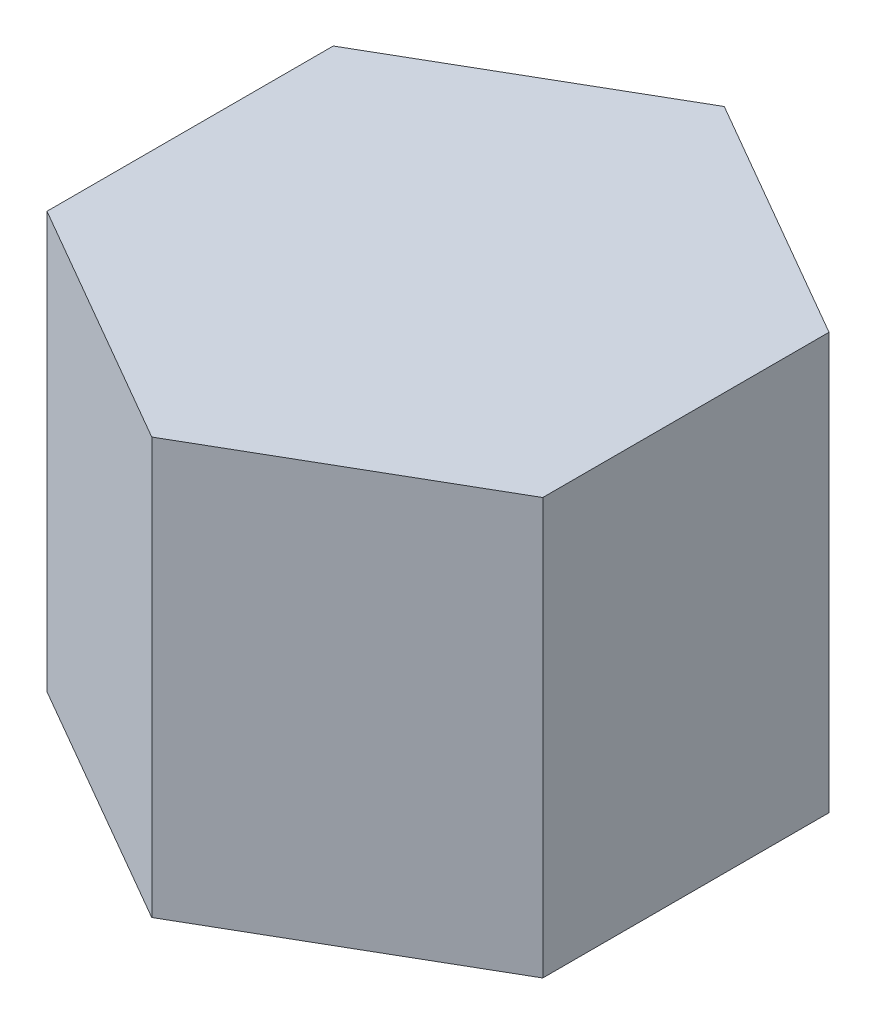
ISO-10303-21;
HEADER;
FILE_DESCRIPTION(('STEP AP214'),'2;1');
FILE_NAME('part.step','',(''),(''),'','','');
FILE_SCHEMA(('AUTOMOTIVE_DESIGN { 1 0 10303 214 1 1 1 1 }'));
ENDSEC;
DATA;
#1=APPLICATION_CONTEXT('core data for automotive mechanical design processes');
#2=APPLICATION_PROTOCOL_DEFINITION('international standard','automotive_design',2000,#1);
#3=PRODUCT_CONTEXT('',#1,'mechanical');
#4=PRODUCT('Part','Part','',(#3));
#5=PRODUCT_RELATED_PRODUCT_CATEGORY('part','',(#4));
#6=PRODUCT_DEFINITION_FORMATION('','',#4);
#7=PRODUCT_DEFINITION_CONTEXT('part definition',#1,'design');
#8=PRODUCT_DEFINITION('design','',#6,#7);
#9=PRODUCT_DEFINITION_SHAPE('','',#8);
#10=(LENGTH_UNIT() NAMED_UNIT(*) SI_UNIT(.MILLI.,.METRE.));
#11=(NAMED_UNIT(*) PLANE_ANGLE_UNIT() SI_UNIT($,.RADIAN.));
#12=(NAMED_UNIT(*) SI_UNIT($,.STERADIAN.) SOLID_ANGLE_UNIT());
#13=UNCERTAINTY_MEASURE_WITH_UNIT(LENGTH_MEASURE(1.E-05),#10,'distance_accuracy_value','');
#14=(GEOMETRIC_REPRESENTATION_CONTEXT(3) GLOBAL_UNCERTAINTY_ASSIGNED_CONTEXT((#13)) GLOBAL_UNIT_ASSIGNED_CONTEXT((#10,
#11,#12)) REPRESENTATION_CONTEXT('',''));
#15=CARTESIAN_POINT('',(0.,0.,0.));
#16=DIRECTION('',(0.,0.,1.));
#17=DIRECTION('',(1.,0.,0.));
#18=AXIS2_PLACEMENT_3D('',#15,#16,#17);
#19=CARTESIAN_POINT('',(205.839551417382,-147.556598747966,287.351844201572));
#20=DIRECTION('',(-0.499999999999943,0.,-0.866025403784471));
#21=DIRECTION('',(-0.866025403784471,0.,0.499999999999943));
#22=AXIS2_PLACEMENT_3D('',#19,#20,#21);
#23=PLANE('',#22);
#24=CARTESIAN_POINT('',(206.142660308706,-147.047793579175,287.176844201572));
#25=DIRECTION('',(-0.866025403784471,0.,0.499999999999943));
#26=VECTOR('',#25,1.);
#27=LINE('',#24,#26);
#28=CARTESIAN_POINT('',(206.142660308706,-147.047793579175,287.176844201572));
#29=VERTEX_POINT('',#28);
#30=CARTESIAN_POINT('',(205.839551417382,-147.047793579175,287.351844201572));
#31=VERTEX_POINT('',#30);
#32=EDGE_CURVE('E170',#29,#31,#27,.T.);
#33=ORIENTED_EDGE('',*,*,#32,.T.);
#34=CARTESIAN_POINT('',(205.839551417382,-147.556598747966,287.351844201572));
#35=DIRECTION('',(0.,1.,0.));
#36=VECTOR('',#35,1.);
#37=LINE('',#34,#36);
#38=CARTESIAN_POINT('',(205.839551417382,-147.556598747966,287.351844201572));
#39=VERTEX_POINT('',#38);
#40=EDGE_CURVE('E35',#39,#31,#37,.T.);
#41=ORIENTED_EDGE('',*,*,#40,.F.);
#42=CARTESIAN_POINT('',(206.142660308706,-147.556598747966,287.176844201572));
#43=DIRECTION('',(-0.866025403784471,0.,0.499999999999943));
#44=VECTOR('',#43,1.);
#45=LINE('',#42,#44);
#46=CARTESIAN_POINT('',(206.142660308706,-147.556598747966,287.176844201572));
#47=VERTEX_POINT('',#46);
#48=EDGE_CURVE('E159',#47,#39,#45,.T.);
#49=ORIENTED_EDGE('',*,*,#48,.F.);
#50=CARTESIAN_POINT('',(206.142660308706,-147.556598747966,287.176844201572));
#51=DIRECTION('',(0.,1.,0.));
#52=VECTOR('',#51,1.);
#53=LINE('',#50,#52);
#54=EDGE_CURVE('E10',#47,#29,#53,.T.);
#55=ORIENTED_EDGE('',*,*,#54,.T.);
#56=EDGE_LOOP('',(#33,#41,#49,#55));
#57=FACE_BOUND('',#56,.T.);
#58=ADVANCED_FACE('F16',(#57),#23,.F.);
#59=CARTESIAN_POINT('',(206.142660308706,-147.556598747966,291.594471220494));
#60=DIRECTION('',(-1.,0.,0.));
#61=DIRECTION('',(0.,-1.,0.));
#62=AXIS2_PLACEMENT_3D('',#59,#60,#61);
#63=PLANE('',#62);
#64=CARTESIAN_POINT('',(206.142660308706,-147.047793579175,286.826844201572));
#65=DIRECTION('',(0.,0.,1.));
#66=VECTOR('',#65,1.);
#67=LINE('',#64,#66);
#68=CARTESIAN_POINT('',(206.142660308706,-147.047793579175,286.826844201572));
#69=VERTEX_POINT('',#68);
#70=EDGE_CURVE('E167',#69,#29,#67,.T.);
#71=ORIENTED_EDGE('',*,*,#70,.T.);
#72=ORIENTED_EDGE('',*,*,#54,.F.);
#73=CARTESIAN_POINT('',(206.142660308706,-147.556598747966,286.826844201572));
#74=DIRECTION('',(0.,0.,1.));
#75=VECTOR('',#74,1.);
#76=LINE('',#73,#75);
#77=CARTESIAN_POINT('',(206.142660308706,-147.556598747966,286.826844201572));
#78=VERTEX_POINT('',#77);
#79=EDGE_CURVE('E156',#78,#47,#76,.T.);
#80=ORIENTED_EDGE('',*,*,#79,.F.);
#81=CARTESIAN_POINT('',(206.142660308706,-147.556598747966,286.826844201572));
#82=DIRECTION('',(0.,1.,0.));
#83=VECTOR('',#82,1.);
#84=LINE('',#81,#83);
#85=EDGE_CURVE('E27',#78,#69,#84,.T.);
#86=ORIENTED_EDGE('',*,*,#85,.T.);
#87=EDGE_LOOP('',(#71,#72,#80,#86));
#88=FACE_BOUND('',#87,.T.);
#89=ADVANCED_FACE('F189',(#88),#63,.F.);
#90=CARTESIAN_POINT('',(206.142660308706,-147.556598747966,286.826844201572));
#91=DIRECTION('',(-0.499999999999943,0.,0.866025403784471));
#92=DIRECTION('',(0.866025403784471,0.,0.499999999999943));
#93=AXIS2_PLACEMENT_3D('',#90,#91,#92);
#94=PLANE('',#93);
#95=CARTESIAN_POINT('',(205.839551417382,-147.047793579175,286.651844201572));
#96=DIRECTION('',(0.866025403784471,0.,0.499999999999943));
#97=VECTOR('',#96,1.);
#98=LINE('',#95,#97);
#99=CARTESIAN_POINT('',(205.839551417382,-147.047793579175,286.651844201572));
#100=VERTEX_POINT('',#99);
#101=EDGE_CURVE('E163',#100,#69,#98,.T.);
#102=ORIENTED_EDGE('',*,*,#101,.T.);
#103=ORIENTED_EDGE('',*,*,#85,.F.);
#104=CARTESIAN_POINT('',(205.839551417382,-147.556598747966,286.651844201572));
#105=DIRECTION('',(0.866025403784471,0.,0.499999999999943));
#106=VECTOR('',#105,1.);
#107=LINE('',#104,#106);
#108=CARTESIAN_POINT('',(205.839551417382,-147.556598747966,286.651844201572));
#109=VERTEX_POINT('',#108);
#110=EDGE_CURVE('E106',#109,#78,#107,.T.);
#111=ORIENTED_EDGE('',*,*,#110,.F.);
#112=CARTESIAN_POINT('',(205.839551417382,-147.556598747966,286.651844201572));
#113=DIRECTION('',(0.,1.,0.));
#114=VECTOR('',#113,1.);
#115=LINE('',#112,#114);
#116=EDGE_CURVE('E94',#109,#100,#115,.T.);
#117=ORIENTED_EDGE('',*,*,#116,.T.);
#118=EDGE_LOOP('',(#102,#103,#111,#117));
#119=FACE_BOUND('',#118,.T.);
#120=ADVANCED_FACE('F198',(#119),#94,.F.);
#121=CARTESIAN_POINT('',(205.839551417382,-147.556598747966,286.651844201572));
#122=DIRECTION('',(0.499999999999978,0.,0.866025403784452));
#123=DIRECTION('',(0.866025403784452,0.,-0.499999999999978));
#124=AXIS2_PLACEMENT_3D('',#121,#122,#123);
#125=PLANE('',#124);
#126=CARTESIAN_POINT('',(205.536442526057,-147.047793579175,286.826844201572));
#127=DIRECTION('',(0.866025403784452,0.,-0.499999999999978));
#128=VECTOR('',#127,1.);
#129=LINE('',#126,#128);
#130=CARTESIAN_POINT('',(205.536442526057,-147.047793579175,286.826844201572));
#131=VERTEX_POINT('',#130);
#132=EDGE_CURVE('E162',#131,#100,#129,.T.);
#133=ORIENTED_EDGE('',*,*,#132,.T.);
#134=ORIENTED_EDGE('',*,*,#116,.F.);
#135=CARTESIAN_POINT('',(205.536442526057,-147.556598747966,286.826844201572));
#136=DIRECTION('',(0.866025403784452,0.,-0.499999999999978));
#137=VECTOR('',#136,1.);
#138=LINE('',#135,#137);
#139=CARTESIAN_POINT('',(205.536442526057,-147.556598747966,286.826844201572));
#140=VERTEX_POINT('',#139);
#141=EDGE_CURVE('E98',#140,#109,#138,.T.);
#142=ORIENTED_EDGE('',*,*,#141,.F.);
#143=CARTESIAN_POINT('',(205.536442526057,-147.556598747966,286.826844201572));
#144=DIRECTION('',(0.,1.,0.));
#145=VECTOR('',#144,1.);
#146=LINE('',#143,#145);
#147=EDGE_CURVE('E79',#140,#131,#146,.T.);
#148=ORIENTED_EDGE('',*,*,#147,.T.);
#149=EDGE_LOOP('',(#133,#134,#142,#148));
#150=FACE_BOUND('',#149,.T.);
#151=ADVANCED_FACE('F100',(#150),#125,.F.);
#152=CARTESIAN_POINT('',(205.536442526057,-147.556598747966,291.594471220494));
#153=DIRECTION('',(1.,0.,0.));
#154=DIRECTION('',(0.,1.,0.));
#155=AXIS2_PLACEMENT_3D('',#152,#153,#154);
#156=PLANE('',#155);
#157=CARTESIAN_POINT('',(205.536442526057,-147.047793579175,287.176844201572));
#158=DIRECTION('',(0.,0.,-1.));
#159=VECTOR('',#158,1.);
#160=LINE('',#157,#159);
#161=CARTESIAN_POINT('',(205.536442526057,-147.047793579175,287.176844201572));
#162=VERTEX_POINT('',#161);
#163=EDGE_CURVE('E88',#162,#131,#160,.T.);
#164=ORIENTED_EDGE('',*,*,#163,.T.);
#165=ORIENTED_EDGE('',*,*,#147,.F.);
#166=CARTESIAN_POINT('',(205.536442526057,-147.556598747966,287.176844201572));
#167=DIRECTION('',(0.,0.,-1.));
#168=VECTOR('',#167,1.);
#169=LINE('',#166,#168);
#170=CARTESIAN_POINT('',(205.536442526057,-147.556598747966,287.176844201572));
#171=VERTEX_POINT('',#170);
#172=EDGE_CURVE('E84',#171,#140,#169,.T.);
#173=ORIENTED_EDGE('',*,*,#172,.F.);
#174=CARTESIAN_POINT('',(205.536442526057,-147.556598747966,287.176844201572));
#175=DIRECTION('',(0.,1.,0.));
#176=VECTOR('',#175,1.);
#177=LINE('',#174,#176);
#178=EDGE_CURVE('E58',#171,#162,#177,.T.);
#179=ORIENTED_EDGE('',*,*,#178,.T.);
#180=EDGE_LOOP('',(#164,#165,#173,#179));
#181=FACE_BOUND('',#180,.T.);
#182=ADVANCED_FACE('F82',(#181),#156,.F.);
#183=CARTESIAN_POINT('',(205.536442526057,-147.556598747966,287.176844201572));
#184=DIRECTION('',(0.499999999999978,0.,-0.866025403784452));
#185=DIRECTION('',(-0.866025403784452,0.,-0.499999999999978));
#186=AXIS2_PLACEMENT_3D('',#183,#184,#185);
#187=PLANE('',#186);
#188=CARTESIAN_POINT('',(205.839551417382,-147.047793579175,287.351844201572));
#189=DIRECTION('',(-0.866025403784452,0.,-0.499999999999978));
#190=VECTOR('',#189,1.);
#191=LINE('',#188,#190);
#192=EDGE_CURVE('E160',#31,#162,#191,.T.);
#193=ORIENTED_EDGE('',*,*,#192,.T.);
#194=ORIENTED_EDGE('',*,*,#178,.F.);
#195=CARTESIAN_POINT('',(205.839551417382,-147.556598747966,287.351844201572));
#196=DIRECTION('',(-0.866025403784452,0.,-0.499999999999978));
#197=VECTOR('',#196,1.);
#198=LINE('',#195,#197);
#199=EDGE_CURVE('E112',#39,#171,#198,.T.);
#200=ORIENTED_EDGE('',*,*,#199,.F.);
#201=ORIENTED_EDGE('',*,*,#40,.T.);
#202=EDGE_LOOP('',(#193,#194,#200,#201));
#203=FACE_BOUND('',#202,.T.);
#204=ADVANCED_FACE('F131',(#203),#187,.F.);
#205=CARTESIAN_POINT('',(206.491105863044,-147.556598747966,291.594471220494));
#206=DIRECTION('',(0.,1.,0.));
#207=DIRECTION('',(-1.,0.,0.));
#208=AXIS2_PLACEMENT_3D('',#205,#206,#207);
#209=PLANE('',#208);
#210=ORIENTED_EDGE('',*,*,#48,.T.);
#211=ORIENTED_EDGE('',*,*,#199,.T.);
#212=ORIENTED_EDGE('',*,*,#172,.T.);
#213=ORIENTED_EDGE('',*,*,#141,.T.);
#214=ORIENTED_EDGE('',*,*,#110,.T.);
#215=ORIENTED_EDGE('',*,*,#79,.T.);
#216=EDGE_LOOP('',(#210,#211,#212,#213,#214,#215));
#217=FACE_BOUND('',#216,.T.);
#218=ADVANCED_FACE('F111',(#217),#209,.F.);
#219=CARTESIAN_POINT('',(206.491105863044,-147.047793579175,291.594471220494));
#220=DIRECTION('',(0.,1.,0.));
#221=DIRECTION('',(-1.,0.,0.));
#222=AXIS2_PLACEMENT_3D('',#219,#220,#221);
#223=PLANE('',#222);
#224=ORIENTED_EDGE('',*,*,#32,.F.);
#225=ORIENTED_EDGE('',*,*,#70,.F.);
#226=ORIENTED_EDGE('',*,*,#101,.F.);
#227=ORIENTED_EDGE('',*,*,#132,.F.);
#228=ORIENTED_EDGE('',*,*,#163,.F.);
#229=ORIENTED_EDGE('',*,*,#192,.F.);
#230=EDGE_LOOP('',(#224,#225,#226,#227,#228,#229));
#231=FACE_BOUND('',#230,.T.);
#232=ADVANCED_FACE('F130',(#231),#223,.T.);
#233=CLOSED_SHELL('',(#58,#89,#120,#151,#182,#204,#218,#232));
#234=MANIFOLD_SOLID_BREP('B1',#233);
#235=ADVANCED_BREP_SHAPE_REPRESENTATION('',(#18,#234),#14);
#236=SHAPE_DEFINITION_REPRESENTATION(#9,#235);
ENDSEC;
END-ISO-10303-21;
